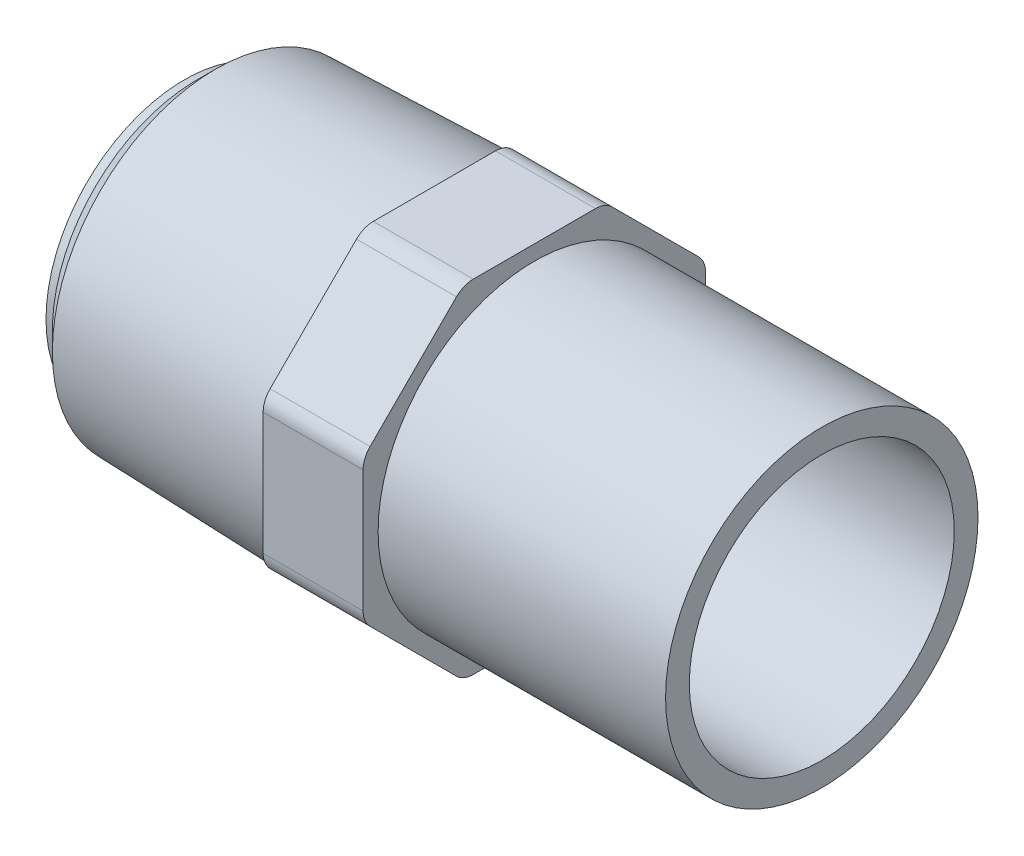
ISO-10303-21;
HEADER;
FILE_DESCRIPTION(('STEP AP214'),'2;1');
FILE_NAME('part.step','',(''),(''),'','','');
FILE_SCHEMA(('AUTOMOTIVE_DESIGN { 1 0 10303 214 1 1 1 1 }'));
ENDSEC;
DATA;
#1=APPLICATION_CONTEXT('core data for automotive mechanical design processes');
#2=APPLICATION_PROTOCOL_DEFINITION('international standard','automotive_design',2000,#1);
#3=PRODUCT_CONTEXT('',#1,'mechanical');
#4=PRODUCT('Part','Part','',(#3));
#5=PRODUCT_RELATED_PRODUCT_CATEGORY('part','',(#4));
#6=PRODUCT_DEFINITION_FORMATION('','',#4);
#7=PRODUCT_DEFINITION_CONTEXT('part definition',#1,'design');
#8=PRODUCT_DEFINITION('design','',#6,#7);
#9=PRODUCT_DEFINITION_SHAPE('','',#8);
#10=(LENGTH_UNIT() NAMED_UNIT(*) SI_UNIT(.MILLI.,.METRE.));
#11=(NAMED_UNIT(*) PLANE_ANGLE_UNIT() SI_UNIT($,.RADIAN.));
#12=(NAMED_UNIT(*) SI_UNIT($,.STERADIAN.) SOLID_ANGLE_UNIT());
#13=UNCERTAINTY_MEASURE_WITH_UNIT(LENGTH_MEASURE(1.E-05),#10,'distance_accuracy_value','');
#14=(GEOMETRIC_REPRESENTATION_CONTEXT(3) GLOBAL_UNCERTAINTY_ASSIGNED_CONTEXT((#13)) GLOBAL_UNIT_ASSIGNED_CONTEXT((#10,
#11,#12)) REPRESENTATION_CONTEXT('',''));
#15=CARTESIAN_POINT('',(0.,0.,0.));
#16=DIRECTION('',(0.,0.,1.));
#17=DIRECTION('',(1.,0.,0.));
#18=AXIS2_PLACEMENT_3D('',#15,#16,#17);
#19=CARTESIAN_POINT('',(-23.,-11.8,4.88772003600251));
#20=DIRECTION('',(1.,0.,0.));
#21=DIRECTION('',(0.,0.,-1.));
#22=AXIS2_PLACEMENT_3D('',#19,#20,#21);
#23=CYLINDRICAL_SURFACE('',#22,1.9);
#24=CARTESIAN_POINT('',(-31.,-11.8,4.88772003600251));
#25=DIRECTION('',(1.,0.,0.));
#26=DIRECTION('',(0.,0.,-1.));
#27=AXIS2_PLACEMENT_3D('',#24,#25,#26);
#28=CIRCLE('',#27,1.9);
#29=CARTESIAN_POINT('',(-31.,-13.7,4.8877200360025));
#30=VERTEX_POINT('',#29);
#31=CARTESIAN_POINT('',(-31.,-13.1435028842544,6.23122292025694));
#32=VERTEX_POINT('',#31);
#33=EDGE_CURVE('E323',#30,#32,#28,.F.);
#34=ORIENTED_EDGE('',*,*,#33,.F.);
#35=DIRECTION('',(1.,0.,0.));
#36=VECTOR('',#35,1.);
#37=CARTESIAN_POINT('',(-31.,-13.7,4.8877200360025));
#38=LINE('',#37,#36);
#39=CARTESIAN_POINT('',(-23.,-13.7,4.8877200360025));
#40=VERTEX_POINT('',#39);
#41=EDGE_CURVE('E218',#40,#30,#38,.F.);
#42=ORIENTED_EDGE('',*,*,#41,.F.);
#43=CARTESIAN_POINT('',(-23.,-11.8,4.88772003600251));
#44=DIRECTION('',(1.,0.,0.));
#45=DIRECTION('',(0.,0.,-1.));
#46=AXIS2_PLACEMENT_3D('',#43,#44,#45);
#47=CIRCLE('',#46,1.9);
#48=CARTESIAN_POINT('',(-23.,-13.1435028842544,6.23122292025695));
#49=VERTEX_POINT('',#48);
#50=EDGE_CURVE('E18',#40,#49,#47,.F.);
#51=ORIENTED_EDGE('',*,*,#50,.T.);
#52=DIRECTION('',(1.,0.,0.));
#53=VECTOR('',#52,1.);
#54=CARTESIAN_POINT('',(-31.,-13.1435028842544,6.23122292025694));
#55=LINE('',#54,#53);
#56=EDGE_CURVE('E203',#32,#49,#55,.T.);
#57=ORIENTED_EDGE('',*,*,#56,.F.);
#58=EDGE_LOOP('',(#34,#42,#51,#57));
#59=FACE_BOUND('',#58,.T.);
#60=ADVANCED_FACE('F15',(#59),#23,.T.);
#61=CARTESIAN_POINT('',(-23.,-11.8,-4.88772003600252));
#62=DIRECTION('',(1.,0.,0.));
#63=DIRECTION('',(0.,0.,-1.));
#64=AXIS2_PLACEMENT_3D('',#61,#62,#63);
#65=CYLINDRICAL_SURFACE('',#64,1.9);
#66=CARTESIAN_POINT('',(-31.,-11.8,-4.88772003600252));
#67=DIRECTION('',(1.,0.,0.));
#68=DIRECTION('',(0.,0.,-1.));
#69=AXIS2_PLACEMENT_3D('',#66,#67,#68);
#70=CIRCLE('',#69,1.9);
#71=CARTESIAN_POINT('',(-31.,-13.1435028842544,-6.23122292025696));
#72=VERTEX_POINT('',#71);
#73=CARTESIAN_POINT('',(-31.,-13.7,-4.88772003600252));
#74=VERTEX_POINT('',#73);
#75=EDGE_CURVE('E325',#72,#74,#70,.F.);
#76=ORIENTED_EDGE('',*,*,#75,.F.);
#77=DIRECTION('',(1.,0.,0.));
#78=VECTOR('',#77,1.);
#79=CARTESIAN_POINT('',(-31.,-13.1435028842544,-6.23122292025696));
#80=LINE('',#79,#78);
#81=CARTESIAN_POINT('',(-23.,-13.1435028842544,-6.23122292025696));
#82=VERTEX_POINT('',#81);
#83=EDGE_CURVE('E227',#82,#72,#80,.F.);
#84=ORIENTED_EDGE('',*,*,#83,.F.);
#85=CARTESIAN_POINT('',(-23.,-11.8,-4.88772003600252));
#86=DIRECTION('',(1.,0.,0.));
#87=DIRECTION('',(0.,0.,-1.));
#88=AXIS2_PLACEMENT_3D('',#85,#86,#87);
#89=CIRCLE('',#88,1.9);
#90=CARTESIAN_POINT('',(-23.,-13.7,-4.88772003600252));
#91=VERTEX_POINT('',#90);
#92=EDGE_CURVE('E336',#82,#91,#89,.F.);
#93=ORIENTED_EDGE('',*,*,#92,.T.);
#94=DIRECTION('',(1.,0.,0.));
#95=VECTOR('',#94,1.);
#96=CARTESIAN_POINT('',(-31.,-13.7,-4.88772003600252));
#97=LINE('',#96,#95);
#98=EDGE_CURVE('E222',#74,#91,#97,.T.);
#99=ORIENTED_EDGE('',*,*,#98,.F.);
#100=EDGE_LOOP('',(#76,#84,#93,#99));
#101=FACE_BOUND('',#100,.T.);
#102=ADVANCED_FACE('F340',(#101),#65,.T.);
#103=CARTESIAN_POINT('',(-23.,-4.88772003600251,-11.8));
#104=DIRECTION('',(1.,0.,0.));
#105=DIRECTION('',(0.,0.,-1.));
#106=AXIS2_PLACEMENT_3D('',#103,#104,#105);
#107=CYLINDRICAL_SURFACE('',#106,1.9);
#108=CARTESIAN_POINT('',(-31.,-4.88772003600251,-11.8));
#109=DIRECTION('',(1.,0.,0.));
#110=DIRECTION('',(0.,0.,-1.));
#111=AXIS2_PLACEMENT_3D('',#108,#109,#110);
#112=CIRCLE('',#111,1.9);
#113=CARTESIAN_POINT('',(-31.,-4.88772003600251,-13.7));
#114=VERTEX_POINT('',#113);
#115=CARTESIAN_POINT('',(-31.,-6.23122292025695,-13.1435028842544));
#116=VERTEX_POINT('',#115);
#117=EDGE_CURVE('E327',#114,#116,#112,.F.);
#118=ORIENTED_EDGE('',*,*,#117,.F.);
#119=DIRECTION('',(1.,0.,0.));
#120=VECTOR('',#119,1.);
#121=CARTESIAN_POINT('',(-31.,-4.88772003600251,-13.7));
#122=LINE('',#121,#120);
#123=CARTESIAN_POINT('',(-23.,-4.88772003600251,-13.7));
#124=VERTEX_POINT('',#123);
#125=EDGE_CURVE('E236',#124,#114,#122,.F.);
#126=ORIENTED_EDGE('',*,*,#125,.F.);
#127=CARTESIAN_POINT('',(-23.,-4.88772003600251,-11.8));
#128=DIRECTION('',(1.,0.,0.));
#129=DIRECTION('',(0.,0.,-1.));
#130=AXIS2_PLACEMENT_3D('',#127,#128,#129);
#131=CIRCLE('',#130,1.9);
#132=CARTESIAN_POINT('',(-23.,-6.23122292025695,-13.1435028842544));
#133=VERTEX_POINT('',#132);
#134=EDGE_CURVE('E335',#124,#133,#131,.F.);
#135=ORIENTED_EDGE('',*,*,#134,.T.);
#136=DIRECTION('',(1.,0.,0.));
#137=VECTOR('',#136,1.);
#138=CARTESIAN_POINT('',(-31.,-6.23122292025695,-13.1435028842544));
#139=LINE('',#138,#137);
#140=EDGE_CURVE('E231',#116,#133,#139,.T.);
#141=ORIENTED_EDGE('',*,*,#140,.F.);
#142=EDGE_LOOP('',(#118,#126,#135,#141));
#143=FACE_BOUND('',#142,.T.);
#144=ADVANCED_FACE('F355',(#143),#107,.T.);
#145=CARTESIAN_POINT('',(-23.,4.88772003600253,-11.8));
#146=DIRECTION('',(1.,0.,0.));
#147=DIRECTION('',(0.,0.,-1.));
#148=AXIS2_PLACEMENT_3D('',#145,#146,#147);
#149=CYLINDRICAL_SURFACE('',#148,1.89999999999999);
#150=CARTESIAN_POINT('',(-31.,4.88772003600253,-11.8));
#151=DIRECTION('',(1.,0.,0.));
#152=DIRECTION('',(0.,0.,-1.));
#153=AXIS2_PLACEMENT_3D('',#150,#151,#152);
#154=CIRCLE('',#153,1.89999999999999);
#155=CARTESIAN_POINT('',(-31.,6.23122292025696,-13.1435028842544));
#156=VERTEX_POINT('',#155);
#157=CARTESIAN_POINT('',(-31.,4.88772003600253,-13.7));
#158=VERTEX_POINT('',#157);
#159=EDGE_CURVE('E271',#156,#158,#154,.F.);
#160=ORIENTED_EDGE('',*,*,#159,.F.);
#161=DIRECTION('',(1.,0.,0.));
#162=VECTOR('',#161,1.);
#163=CARTESIAN_POINT('',(-31.,6.23122292025696,-13.1435028842544));
#164=LINE('',#163,#162);
#165=CARTESIAN_POINT('',(-23.,6.23122292025696,-13.1435028842544));
#166=VERTEX_POINT('',#165);
#167=EDGE_CURVE('E245',#166,#156,#164,.F.);
#168=ORIENTED_EDGE('',*,*,#167,.F.);
#169=CARTESIAN_POINT('',(-23.,4.88772003600253,-11.8));
#170=DIRECTION('',(1.,0.,0.));
#171=DIRECTION('',(0.,0.,-1.));
#172=AXIS2_PLACEMENT_3D('',#169,#170,#171);
#173=CIRCLE('',#172,1.89999999999999);
#174=CARTESIAN_POINT('',(-23.,4.88772003600253,-13.7));
#175=VERTEX_POINT('',#174);
#176=EDGE_CURVE('E333',#166,#175,#173,.F.);
#177=ORIENTED_EDGE('',*,*,#176,.T.);
#178=DIRECTION('',(1.,0.,0.));
#179=VECTOR('',#178,1.);
#180=CARTESIAN_POINT('',(-31.,4.88772003600253,-13.7));
#181=LINE('',#180,#179);
#182=EDGE_CURVE('E240',#158,#175,#181,.T.);
#183=ORIENTED_EDGE('',*,*,#182,.F.);
#184=EDGE_LOOP('',(#160,#168,#177,#183));
#185=FACE_BOUND('',#184,.T.);
#186=ADVANCED_FACE('F360',(#185),#149,.T.);
#187=CARTESIAN_POINT('',(-23.,11.8,-4.88772003600252));
#188=DIRECTION('',(1.,0.,0.));
#189=DIRECTION('',(0.,0.,-1.));
#190=AXIS2_PLACEMENT_3D('',#187,#188,#189);
#191=CYLINDRICAL_SURFACE('',#190,1.9);
#192=CARTESIAN_POINT('',(-31.,11.8,-4.88772003600252));
#193=DIRECTION('',(1.,0.,0.));
#194=DIRECTION('',(0.,0.,-1.));
#195=AXIS2_PLACEMENT_3D('',#192,#193,#194);
#196=CIRCLE('',#195,1.9);
#197=CARTESIAN_POINT('',(-31.,13.7,-4.88772003600252));
#198=VERTEX_POINT('',#197);
#199=CARTESIAN_POINT('',(-31.,13.1435028842544,-6.23122292025696));
#200=VERTEX_POINT('',#199);
#201=EDGE_CURVE('E269',#198,#200,#196,.F.);
#202=ORIENTED_EDGE('',*,*,#201,.F.);
#203=DIRECTION('',(1.,0.,0.));
#204=VECTOR('',#203,1.);
#205=CARTESIAN_POINT('',(-31.,13.7,-4.88772003600252));
#206=LINE('',#205,#204);
#207=CARTESIAN_POINT('',(-23.,13.7,-4.88772003600252));
#208=VERTEX_POINT('',#207);
#209=EDGE_CURVE('E254',#208,#198,#206,.F.);
#210=ORIENTED_EDGE('',*,*,#209,.F.);
#211=CARTESIAN_POINT('',(-23.,11.8,-4.88772003600252));
#212=DIRECTION('',(1.,0.,0.));
#213=DIRECTION('',(0.,0.,-1.));
#214=AXIS2_PLACEMENT_3D('',#211,#212,#213);
#215=CIRCLE('',#214,1.9);
#216=CARTESIAN_POINT('',(-23.,13.1435028842544,-6.23122292025696));
#217=VERTEX_POINT('',#216);
#218=EDGE_CURVE('E268',#208,#217,#215,.F.);
#219=ORIENTED_EDGE('',*,*,#218,.T.);
#220=DIRECTION('',(1.,0.,0.));
#221=VECTOR('',#220,1.);
#222=CARTESIAN_POINT('',(-31.,13.1435028842544,-6.23122292025696));
#223=LINE('',#222,#221);
#224=EDGE_CURVE('E249',#200,#217,#223,.T.);
#225=ORIENTED_EDGE('',*,*,#224,.F.);
#226=EDGE_LOOP('',(#202,#210,#219,#225));
#227=FACE_BOUND('',#226,.T.);
#228=ADVANCED_FACE('F266',(#227),#191,.T.);
#229=CARTESIAN_POINT('',(-23.,11.8,4.88772003600253));
#230=DIRECTION('',(1.,0.,0.));
#231=DIRECTION('',(0.,0.,-1.));
#232=AXIS2_PLACEMENT_3D('',#229,#230,#231);
#233=CYLINDRICAL_SURFACE('',#232,1.9);
#234=CARTESIAN_POINT('',(-31.,11.8,4.88772003600253));
#235=DIRECTION('',(1.,0.,0.));
#236=DIRECTION('',(0.,0.,-1.));
#237=AXIS2_PLACEMENT_3D('',#234,#235,#236);
#238=CIRCLE('',#237,1.9);
#239=CARTESIAN_POINT('',(-31.,13.1435028842544,6.23122292025697));
#240=VERTEX_POINT('',#239);
#241=CARTESIAN_POINT('',(-31.,13.7,4.88772003600253));
#242=VERTEX_POINT('',#241);
#243=EDGE_CURVE('E143',#240,#242,#238,.F.);
#244=ORIENTED_EDGE('',*,*,#243,.F.);
#245=DIRECTION('',(1.,0.,0.));
#246=VECTOR('',#245,1.);
#247=CARTESIAN_POINT('',(-31.,13.1435028842544,6.23122292025697));
#248=LINE('',#247,#246);
#249=CARTESIAN_POINT('',(-23.,13.1435028842544,6.23122292025697));
#250=VERTEX_POINT('',#249);
#251=EDGE_CURVE('E154',#250,#240,#248,.F.);
#252=ORIENTED_EDGE('',*,*,#251,.F.);
#253=CARTESIAN_POINT('',(-23.,11.8,4.88772003600253));
#254=DIRECTION('',(1.,0.,0.));
#255=DIRECTION('',(0.,0.,-1.));
#256=AXIS2_PLACEMENT_3D('',#253,#254,#255);
#257=CIRCLE('',#256,1.9);
#258=CARTESIAN_POINT('',(-23.,13.7,4.88772003600253));
#259=VERTEX_POINT('',#258);
#260=EDGE_CURVE('E277',#250,#259,#257,.F.);
#261=ORIENTED_EDGE('',*,*,#260,.T.);
#262=DIRECTION('',(1.,0.,0.));
#263=VECTOR('',#262,1.);
#264=CARTESIAN_POINT('',(-31.,13.7,4.88772003600253));
#265=LINE('',#264,#263);
#266=EDGE_CURVE('E156',#242,#259,#265,.T.);
#267=ORIENTED_EDGE('',*,*,#266,.F.);
#268=EDGE_LOOP('',(#244,#252,#261,#267));
#269=FACE_BOUND('',#268,.T.);
#270=ADVANCED_FACE('F276',(#269),#233,.T.);
#271=CARTESIAN_POINT('',(-23.,4.88772003600252,11.8));
#272=DIRECTION('',(1.,0.,0.));
#273=DIRECTION('',(0.,0.,-1.));
#274=AXIS2_PLACEMENT_3D('',#271,#272,#273);
#275=CYLINDRICAL_SURFACE('',#274,1.90000000000001);
#276=CARTESIAN_POINT('',(-31.,4.88772003600252,11.8));
#277=DIRECTION('',(1.,0.,0.));
#278=DIRECTION('',(0.,0.,-1.));
#279=AXIS2_PLACEMENT_3D('',#276,#277,#278);
#280=CIRCLE('',#279,1.90000000000001);
#281=CARTESIAN_POINT('',(-31.,4.88772003600253,13.7));
#282=VERTEX_POINT('',#281);
#283=CARTESIAN_POINT('',(-31.,6.23122292025696,13.1435028842544));
#284=VERTEX_POINT('',#283);
#285=EDGE_CURVE('E131',#282,#284,#280,.F.);
#286=ORIENTED_EDGE('',*,*,#285,.F.);
#287=DIRECTION('',(1.,0.,0.));
#288=VECTOR('',#287,1.);
#289=CARTESIAN_POINT('',(-31.,4.88772003600253,13.7));
#290=LINE('',#289,#288);
#291=CARTESIAN_POINT('',(-23.,4.88772003600253,13.7));
#292=VERTEX_POINT('',#291);
#293=EDGE_CURVE('E150',#292,#282,#290,.F.);
#294=ORIENTED_EDGE('',*,*,#293,.F.);
#295=CARTESIAN_POINT('',(-23.,4.88772003600252,11.8));
#296=DIRECTION('',(1.,0.,0.));
#297=DIRECTION('',(0.,0.,-1.));
#298=AXIS2_PLACEMENT_3D('',#295,#296,#297);
#299=CIRCLE('',#298,1.90000000000001);
#300=CARTESIAN_POINT('',(-23.,6.23122292025696,13.1435028842544));
#301=VERTEX_POINT('',#300);
#302=EDGE_CURVE('E33',#292,#301,#299,.F.);
#303=ORIENTED_EDGE('',*,*,#302,.T.);
#304=DIRECTION('',(1.,0.,0.));
#305=VECTOR('',#304,1.);
#306=CARTESIAN_POINT('',(-31.,6.23122292025696,13.1435028842544));
#307=LINE('',#306,#305);
#308=EDGE_CURVE('E146',#284,#301,#307,.T.);
#309=ORIENTED_EDGE('',*,*,#308,.F.);
#310=EDGE_LOOP('',(#286,#294,#303,#309));
#311=FACE_BOUND('',#310,.T.);
#312=ADVANCED_FACE('F147',(#311),#275,.T.);
#313=CARTESIAN_POINT('',(-31.,-13.7,13.7));
#314=DIRECTION('',(-1.,0.,0.));
#315=DIRECTION('',(0.,1.,0.));
#316=AXIS2_PLACEMENT_3D('',#313,#314,#315);
#317=PLANE('',#316);
#318=CARTESIAN_POINT('',(-31.,0.,0.));
#319=DIRECTION('',(1.,0.,0.));
#320=DIRECTION('',(0.,0.,-1.));
#321=AXIS2_PLACEMENT_3D('',#318,#319,#320);
#322=CIRCLE('',#321,13.606788060305);
#323=CARTESIAN_POINT('',(-31.,0.,-13.606788060305));
#324=VERTEX_POINT('',#323);
#325=EDGE_CURVE('E206',#324,#324,#322,.F.);
#326=ORIENTED_EDGE('',*,*,#325,.F.);
#327=EDGE_LOOP('',(#326));
#328=FACE_BOUND('',#327,.T.);
#329=ORIENTED_EDGE('',*,*,#33,.T.);
#330=DIRECTION('',(0.,-0.707106781186547,-0.707106781186548));
#331=VECTOR('',#330,1.);
#332=CARTESIAN_POINT('',(-31.,-9.68736290225571,9.68736290225569));
#333=LINE('',#332,#331);
#334=CARTESIAN_POINT('',(-31.,-6.23122292025696,13.1435028842544));
#335=VERTEX_POINT('',#334);
#336=EDGE_CURVE('E200',#335,#32,#333,.T.);
#337=ORIENTED_EDGE('',*,*,#336,.F.);
#338=CARTESIAN_POINT('',(-31.,-4.88772003600251,11.8));
#339=DIRECTION('',(1.,0.,0.));
#340=DIRECTION('',(0.,0.,-1.));
#341=AXIS2_PLACEMENT_3D('',#338,#339,#340);
#342=CIRCLE('',#341,1.90000000000002);
#343=CARTESIAN_POINT('',(-31.,-4.88772003600252,13.7));
#344=VERTEX_POINT('',#343);
#345=EDGE_CURVE('E319',#344,#335,#342,.T.);
#346=ORIENTED_EDGE('',*,*,#345,.F.);
#347=DIRECTION('',(0.,-1.,0.));
#348=VECTOR('',#347,1.);
#349=CARTESIAN_POINT('',(-31.,0.,13.7));
#350=LINE('',#349,#348);
#351=EDGE_CURVE('E141',#282,#344,#350,.T.);
#352=ORIENTED_EDGE('',*,*,#351,.F.);
#353=ORIENTED_EDGE('',*,*,#285,.T.);
#354=DIRECTION('',(0.,-0.707106781186548,0.707106781186547));
#355=VECTOR('',#354,1.);
#356=CARTESIAN_POINT('',(-31.,9.6873629022557,9.68736290225571));
#357=LINE('',#356,#355);
#358=EDGE_CURVE('E138',#240,#284,#357,.T.);
#359=ORIENTED_EDGE('',*,*,#358,.F.);
#360=ORIENTED_EDGE('',*,*,#243,.T.);
#361=DIRECTION('',(0.,0.,1.));
#362=VECTOR('',#361,1.);
#363=CARTESIAN_POINT('',(-31.,13.7,0.));
#364=LINE('',#363,#362);
#365=EDGE_CURVE('E255',#198,#242,#364,.T.);
#366=ORIENTED_EDGE('',*,*,#365,.F.);
#367=ORIENTED_EDGE('',*,*,#201,.T.);
#368=DIRECTION('',(0.,0.707106781186547,0.707106781186547));
#369=VECTOR('',#368,1.);
#370=CARTESIAN_POINT('',(-31.,9.6873629022557,-9.6873629022557));
#371=LINE('',#370,#369);
#372=EDGE_CURVE('E246',#156,#200,#371,.T.);
#373=ORIENTED_EDGE('',*,*,#372,.F.);
#374=ORIENTED_EDGE('',*,*,#159,.T.);
#375=DIRECTION('',(0.,1.,0.));
#376=VECTOR('',#375,1.);
#377=CARTESIAN_POINT('',(-31.,0.,-13.7));
#378=LINE('',#377,#376);
#379=EDGE_CURVE('E237',#114,#158,#378,.T.);
#380=ORIENTED_EDGE('',*,*,#379,.F.);
#381=ORIENTED_EDGE('',*,*,#117,.T.);
#382=DIRECTION('',(0.,0.707106781186548,-0.707106781186547));
#383=VECTOR('',#382,1.);
#384=CARTESIAN_POINT('',(-31.,-9.68736290225569,-9.6873629022557));
#385=LINE('',#384,#383);
#386=EDGE_CURVE('E228',#72,#116,#385,.T.);
#387=ORIENTED_EDGE('',*,*,#386,.F.);
#388=ORIENTED_EDGE('',*,*,#75,.T.);
#389=DIRECTION('',(0.,0.,-1.));
#390=VECTOR('',#389,1.);
#391=CARTESIAN_POINT('',(-31.,-13.7,0.));
#392=LINE('',#391,#390);
#393=EDGE_CURVE('E219',#30,#74,#392,.T.);
#394=ORIENTED_EDGE('',*,*,#393,.F.);
#395=EDGE_LOOP('',(#329,#337,#346,#352,#353,#359,#360,#366,#367,#373,#374,#380,#381,#387,#388,#394));
#396=FACE_BOUND('',#395,.T.);
#397=ADVANCED_FACE('F136',(#328,#396),#317,.T.);
#398=CARTESIAN_POINT('',(-23.,-4.88772003600251,11.8));
#399=DIRECTION('',(1.,0.,0.));
#400=DIRECTION('',(0.,0.,-1.));
#401=AXIS2_PLACEMENT_3D('',#398,#399,#400);
#402=CYLINDRICAL_SURFACE('',#401,1.90000000000002);
#403=ORIENTED_EDGE('',*,*,#345,.T.);
#404=DIRECTION('',(1.,0.,0.));
#405=VECTOR('',#404,1.);
#406=CARTESIAN_POINT('',(-31.,-6.23122292025696,13.1435028842544));
#407=LINE('',#406,#405);
#408=CARTESIAN_POINT('',(-23.,-6.23122292025696,13.1435028842544));
#409=VERTEX_POINT('',#408);
#410=EDGE_CURVE('E204',#409,#335,#407,.F.);
#411=ORIENTED_EDGE('',*,*,#410,.F.);
#412=CARTESIAN_POINT('',(-23.,-4.88772003600251,11.8));
#413=DIRECTION('',(1.,0.,0.));
#414=DIRECTION('',(0.,0.,-1.));
#415=AXIS2_PLACEMENT_3D('',#412,#413,#414);
#416=CIRCLE('',#415,1.90000000000002);
#417=CARTESIAN_POINT('',(-23.,-4.88772003600251,13.7));
#418=VERTEX_POINT('',#417);
#419=EDGE_CURVE('E83',#409,#418,#416,.F.);
#420=ORIENTED_EDGE('',*,*,#419,.T.);
#421=DIRECTION('',(1.,0.,0.));
#422=VECTOR('',#421,1.);
#423=CARTESIAN_POINT('',(-31.,-4.88772003600252,13.7));
#424=LINE('',#423,#422);
#425=EDGE_CURVE('E196',#344,#418,#424,.T.);
#426=ORIENTED_EDGE('',*,*,#425,.F.);
#427=EDGE_LOOP('',(#403,#411,#420,#426));
#428=FACE_BOUND('',#427,.T.);
#429=ADVANCED_FACE('F493',(#428),#402,.T.);
#430=CARTESIAN_POINT('',(-48.5033853320326,0.,0.));
#431=DIRECTION('',(1.,0.,0.));
#432=DIRECTION('',(0.,0.,-1.));
#433=AXIS2_PLACEMENT_3D('',#430,#431,#432);
#434=CONICAL_SURFACE('',#433,13.0616146679674,0.0311366738555786);
#435=CARTESIAN_POINT('',(-48.5033853320326,0.,0.));
#436=DIRECTION('',(-1.,0.,0.));
#437=DIRECTION('',(0.,1.,0.));
#438=AXIS2_PLACEMENT_3D('',#435,#436,#437);
#439=CIRCLE('',#438,13.0616146679674);
#440=CARTESIAN_POINT('',(-48.5033853320326,13.0616146679674,0.));
#441=VERTEX_POINT('',#440);
#442=EDGE_CURVE('E189',#441,#441,#439,.T.);
#443=ORIENTED_EDGE('',*,*,#442,.F.);
#444=EDGE_LOOP('',(#443));
#445=FACE_BOUND('',#444,.T.);
#446=ORIENTED_EDGE('',*,*,#325,.T.);
#447=EDGE_LOOP('',(#446));
#448=FACE_BOUND('',#447,.T.);
#449=ADVANCED_FACE('F485',(#445,#448),#434,.T.);
#450=CARTESIAN_POINT('',(-31.,-6.23122292025696,13.1435028842544));
#451=DIRECTION('',(0.,-0.707106781186548,0.707106781186547));
#452=DIRECTION('',(0.,-0.707106781186547,-0.707106781186548));
#453=AXIS2_PLACEMENT_3D('',#450,#451,#452);
#454=PLANE('',#453);
#455=ORIENTED_EDGE('',*,*,#336,.T.);
#456=ORIENTED_EDGE('',*,*,#56,.T.);
#457=CARTESIAN_POINT('',(-23.,-6.23122292025696,13.1435028842544));
#458=CARTESIAN_POINT('',(-23.,-6.51923458542352,12.8554912190879));
#459=CARTESIAN_POINT('',(-23.,-6.80724625059009,12.5674795539213));
#460=CARTESIAN_POINT('',(-23.,-7.38326958092321,11.9914562235882));
#461=CARTESIAN_POINT('',(-23.,-7.67128124608977,11.7034445584216));
#462=CARTESIAN_POINT('',(-23.,-8.24730457642289,11.1274212280885));
#463=CARTESIAN_POINT('',(-23.,-8.53531624158945,10.8394095629219));
#464=CARTESIAN_POINT('',(-23.,-9.11133957192258,10.2633862325888));
#465=CARTESIAN_POINT('',(-23.,-9.39935123708914,9.97537456742226));
#466=CARTESIAN_POINT('',(-23.,-9.97537456742226,9.39935123708914));
#467=CARTESIAN_POINT('',(-23.,-10.2633862325888,9.11133957192257));
#468=CARTESIAN_POINT('',(-23.,-10.8394095629219,8.53531624158945));
#469=CARTESIAN_POINT('',(-23.,-11.1274212280885,8.24730457642288));
#470=CARTESIAN_POINT('',(-23.,-11.7034445584216,7.67128124608976));
#471=CARTESIAN_POINT('',(-23.,-11.9914562235882,7.3832695809232));
#472=CARTESIAN_POINT('',(-23.,-12.5674795539213,6.80724625059008));
#473=CARTESIAN_POINT('',(-23.,-12.8554912190879,6.51923458542351));
#474=CARTESIAN_POINT('',(-23.,-13.1435028842544,6.23122292025695));
#475=B_SPLINE_CURVE_WITH_KNOTS('',3,(#457,#458,#459,#460,#461,#462,#463,#464,#465,#466,#467,
#468,#469,#470,#471,#472,#473,#474),.UNSPECIFIED.,.F.,.F.,(4,2,2,2,2,2,2,2,4),(0.,
1.22193000900063,2.44386001800126,3.66579002700189,4.88772003600252,6.10965004500316,
7.33158005400379,8.55351006300442,9.77544007200505),.UNSPECIFIED.);
#476=EDGE_CURVE('E195',#409,#49,#475,.T.);
#477=ORIENTED_EDGE('',*,*,#476,.F.);
#478=ORIENTED_EDGE('',*,*,#410,.T.);
#479=EDGE_LOOP('',(#455,#456,#477,#478));
#480=FACE_BOUND('',#479,.T.);
#481=ADVANCED_FACE('F478',(#480),#454,.T.);
#482=CARTESIAN_POINT('',(-31.,-13.7,4.8877200360025));
#483=DIRECTION('',(0.,-1.,0.));
#484=DIRECTION('',(0.,0.,-1.));
#485=AXIS2_PLACEMENT_3D('',#482,#483,#484);
#486=PLANE('',#485);
#487=ORIENTED_EDGE('',*,*,#393,.T.);
#488=ORIENTED_EDGE('',*,*,#98,.T.);
#489=DIRECTION('',(0.,0.,-1.));
#490=VECTOR('',#489,1.);
#491=CARTESIAN_POINT('',(-23.,-13.7,13.7));
#492=LINE('',#491,#490);
#493=EDGE_CURVE('E209',#40,#91,#492,.T.);
#494=ORIENTED_EDGE('',*,*,#493,.F.);
#495=ORIENTED_EDGE('',*,*,#41,.T.);
#496=EDGE_LOOP('',(#487,#488,#494,#495));
#497=FACE_BOUND('',#496,.T.);
#498=ADVANCED_FACE('F344',(#497),#486,.T.);
#499=CARTESIAN_POINT('',(-31.,-13.1435028842544,-6.23122292025696));
#500=DIRECTION('',(0.,-0.707106781186547,-0.707106781186548));
#501=DIRECTION('',(0.,0.707106781186548,-0.707106781186547));
#502=AXIS2_PLACEMENT_3D('',#499,#500,#501);
#503=PLANE('',#502);
#504=ORIENTED_EDGE('',*,*,#386,.T.);
#505=ORIENTED_EDGE('',*,*,#140,.T.);
#506=CARTESIAN_POINT('',(-23.,-13.1435028842544,-6.23122292025696));
#507=CARTESIAN_POINT('',(-23.,-12.8554912190879,-6.51923458542352));
#508=CARTESIAN_POINT('',(-23.,-12.5674795539213,-6.80724625059008));
#509=CARTESIAN_POINT('',(-23.,-11.9914562235882,-7.38326958092321));
#510=CARTESIAN_POINT('',(-23.,-11.7034445584216,-7.67128124608977));
#511=CARTESIAN_POINT('',(-23.,-11.1274212280885,-8.24730457642289));
#512=CARTESIAN_POINT('',(-23.,-10.8394095629219,-8.53531624158946));
#513=CARTESIAN_POINT('',(-23.,-10.2633862325888,-9.11133957192258));
#514=CARTESIAN_POINT('',(-23.,-9.97537456742226,-9.39935123708914));
#515=CARTESIAN_POINT('',(-23.,-9.39935123708913,-9.97537456742226));
#516=CARTESIAN_POINT('',(-23.,-9.11133957192257,-10.2633862325888));
#517=CARTESIAN_POINT('',(-23.,-8.53531624158945,-10.8394095629219));
#518=CARTESIAN_POINT('',(-23.,-8.24730457642289,-11.1274212280885));
#519=CARTESIAN_POINT('',(-23.,-7.67128124608976,-11.7034445584216));
#520=CARTESIAN_POINT('',(-23.,-7.3832695809232,-11.9914562235882));
#521=CARTESIAN_POINT('',(-23.,-6.80724625059008,-12.5674795539213));
#522=CARTESIAN_POINT('',(-23.,-6.51923458542351,-12.8554912190879));
#523=CARTESIAN_POINT('',(-23.,-6.23122292025695,-13.1435028842544));
#524=B_SPLINE_CURVE_WITH_KNOTS('',3,(#506,#507,#508,#509,#510,#511,#512,#513,#514,#515,#516,
#517,#518,#519,#520,#521,#522,#523),.UNSPECIFIED.,.F.,.F.,(4,2,2,2,2,2,2,2,4),(0.,
1.22193000900063,2.44386001800126,3.66579002700189,4.88772003600252,6.10965004500315,
7.33158005400379,8.55351006300442,9.77544007200505),.UNSPECIFIED.);
#525=EDGE_CURVE('E283',#82,#133,#524,.T.);
#526=ORIENTED_EDGE('',*,*,#525,.F.);
#527=ORIENTED_EDGE('',*,*,#83,.T.);
#528=EDGE_LOOP('',(#504,#505,#526,#527));
#529=FACE_BOUND('',#528,.T.);
#530=ADVANCED_FACE('F351',(#529),#503,.T.);
#531=CARTESIAN_POINT('',(-31.,-4.88772003600251,-13.7));
#532=DIRECTION('',(0.,0.,-1.));
#533=DIRECTION('',(0.,1.,0.));
#534=AXIS2_PLACEMENT_3D('',#531,#532,#533);
#535=PLANE('',#534);
#536=ORIENTED_EDGE('',*,*,#379,.T.);
#537=ORIENTED_EDGE('',*,*,#182,.T.);
#538=DIRECTION('',(0.,1.,0.));
#539=VECTOR('',#538,1.);
#540=CARTESIAN_POINT('',(-23.,0.,-13.7));
#541=LINE('',#540,#539);
#542=EDGE_CURVE('E280',#124,#175,#541,.T.);
#543=ORIENTED_EDGE('',*,*,#542,.F.);
#544=ORIENTED_EDGE('',*,*,#125,.T.);
#545=EDGE_LOOP('',(#536,#537,#543,#544));
#546=FACE_BOUND('',#545,.T.);
#547=ADVANCED_FACE('F357',(#546),#535,.T.);
#548=CARTESIAN_POINT('',(-31.,6.23122292025696,-13.1435028842544));
#549=DIRECTION('',(0.,0.707106781186547,-0.707106781186547));
#550=DIRECTION('',(0.,0.707106781186547,0.707106781186547));
#551=AXIS2_PLACEMENT_3D('',#548,#549,#550);
#552=PLANE('',#551);
#553=ORIENTED_EDGE('',*,*,#372,.T.);
#554=ORIENTED_EDGE('',*,*,#224,.T.);
#555=CARTESIAN_POINT('',(-23.,6.23122292025696,-13.1435028842544));
#556=CARTESIAN_POINT('',(-23.,6.51923458542352,-12.8554912190879));
#557=CARTESIAN_POINT('',(-23.,6.80724625059009,-12.5674795539213));
#558=CARTESIAN_POINT('',(-23.,7.38326958092321,-11.9914562235882));
#559=CARTESIAN_POINT('',(-23.,7.67128124608977,-11.7034445584216));
#560=CARTESIAN_POINT('',(-23.,8.2473045764229,-11.1274212280885));
#561=CARTESIAN_POINT('',(-23.,8.53531624158945,-10.8394095629219));
#562=CARTESIAN_POINT('',(-23.,9.11133957192258,-10.2633862325888));
#563=CARTESIAN_POINT('',(-23.,9.39935123708914,-9.97537456742226));
#564=CARTESIAN_POINT('',(-23.,9.97537456742226,-9.39935123708914));
#565=CARTESIAN_POINT('',(-23.,10.2633862325888,-9.11133957192258));
#566=CARTESIAN_POINT('',(-23.,10.8394095629219,-8.53531624158945));
#567=CARTESIAN_POINT('',(-23.,11.1274212280885,-8.24730457642289));
#568=CARTESIAN_POINT('',(-23.,11.7034445584216,-7.67128124608977));
#569=CARTESIAN_POINT('',(-23.,11.9914562235882,-7.38326958092321));
#570=CARTESIAN_POINT('',(-23.,12.5674795539213,-6.80724625059009));
#571=CARTESIAN_POINT('',(-23.,12.8554912190879,-6.51923458542353));
#572=CARTESIAN_POINT('',(-23.,13.1435028842544,-6.23122292025696));
#573=B_SPLINE_CURVE_WITH_KNOTS('',3,(#555,#556,#557,#558,#559,#560,#561,#562,#563,#564,#565,
#566,#567,#568,#569,#570,#571,#572),.UNSPECIFIED.,.F.,.F.,(4,2,2,2,2,2,2,2,4),(0.,
1.22193000900063,2.44386001800126,3.66579002700189,4.88772003600252,6.10965004500315,
7.33158005400379,8.55351006300441,9.77544007200505),.UNSPECIFIED.);
#574=EDGE_CURVE('E279',#166,#217,#573,.T.);
#575=ORIENTED_EDGE('',*,*,#574,.F.);
#576=ORIENTED_EDGE('',*,*,#167,.T.);
#577=EDGE_LOOP('',(#553,#554,#575,#576));
#578=FACE_BOUND('',#577,.T.);
#579=ADVANCED_FACE('F363',(#578),#552,.T.);
#580=CARTESIAN_POINT('',(-31.,13.7,-4.88772003600252));
#581=DIRECTION('',(0.,1.,0.));
#582=DIRECTION('',(0.,0.,1.));
#583=AXIS2_PLACEMENT_3D('',#580,#581,#582);
#584=PLANE('',#583);
#585=ORIENTED_EDGE('',*,*,#365,.T.);
#586=ORIENTED_EDGE('',*,*,#266,.T.);
#587=DIRECTION('',(0.,0.,-1.));
#588=VECTOR('',#587,1.);
#589=CARTESIAN_POINT('',(-23.,13.7,13.7));
#590=LINE('',#589,#588);
#591=EDGE_CURVE('E167',#208,#259,#590,.F.);
#592=ORIENTED_EDGE('',*,*,#591,.F.);
#593=ORIENTED_EDGE('',*,*,#209,.T.);
#594=EDGE_LOOP('',(#585,#586,#592,#593));
#595=FACE_BOUND('',#594,.T.);
#596=ADVANCED_FACE('F261',(#595),#584,.T.);
#597=CARTESIAN_POINT('',(-31.,13.1435028842544,6.23122292025697));
#598=DIRECTION('',(0.,0.707106781186547,0.707106781186548));
#599=DIRECTION('',(0.,-0.707106781186548,0.707106781186547));
#600=AXIS2_PLACEMENT_3D('',#597,#598,#599);
#601=PLANE('',#600);
#602=ORIENTED_EDGE('',*,*,#358,.T.);
#603=ORIENTED_EDGE('',*,*,#308,.T.);
#604=CARTESIAN_POINT('',(-23.,13.1435028842544,6.23122292025697));
#605=CARTESIAN_POINT('',(-23.,12.8554912190879,6.51923458542353));
#606=CARTESIAN_POINT('',(-23.,12.5674795539213,6.80724625059009));
#607=CARTESIAN_POINT('',(-23.,11.9914562235882,7.38326958092322));
#608=CARTESIAN_POINT('',(-23.,11.7034445584216,7.67128124608978));
#609=CARTESIAN_POINT('',(-23.,11.1274212280885,8.2473045764229));
#610=CARTESIAN_POINT('',(-23.,10.8394095629219,8.53531624158946));
#611=CARTESIAN_POINT('',(-23.,10.2633862325888,9.11133957192258));
#612=CARTESIAN_POINT('',(-23.,9.97537456742226,9.39935123708914));
#613=CARTESIAN_POINT('',(-23.,9.39935123708914,9.97537456742227));
#614=CARTESIAN_POINT('',(-23.,9.11133957192258,10.2633862325888));
#615=CARTESIAN_POINT('',(-23.,8.53531624158945,10.839409562922));
#616=CARTESIAN_POINT('',(-23.,8.24730457642289,11.1274212280885));
#617=CARTESIAN_POINT('',(-23.,7.67128124608977,11.7034445584216));
#618=CARTESIAN_POINT('',(-23.,7.38326958092321,11.9914562235882));
#619=CARTESIAN_POINT('',(-23.,6.80724625059008,12.5674795539213));
#620=CARTESIAN_POINT('',(-23.,6.51923458542352,12.8554912190879));
#621=CARTESIAN_POINT('',(-23.,6.23122292025696,13.1435028842544));
#622=B_SPLINE_CURVE_WITH_KNOTS('',3,(#604,#605,#606,#607,#608,#609,#610,#611,#612,#613,#614,
#615,#616,#617,#618,#619,#620,#621),.UNSPECIFIED.,.F.,.F.,(4,2,2,2,2,2,2,2,4),(0.,
1.22193000900063,2.44386001800126,3.66579002700189,4.88772003600252,6.10965004500315,
7.33158005400378,8.55351006300441,9.77544007200504),.UNSPECIFIED.);
#623=EDGE_CURVE('E162',#250,#301,#622,.T.);
#624=ORIENTED_EDGE('',*,*,#623,.F.);
#625=ORIENTED_EDGE('',*,*,#251,.T.);
#626=EDGE_LOOP('',(#602,#603,#624,#625));
#627=FACE_BOUND('',#626,.T.);
#628=ADVANCED_FACE('F152',(#627),#601,.T.);
#629=CARTESIAN_POINT('',(-31.,4.88772003600253,13.7));
#630=DIRECTION('',(0.,0.,1.));
#631=DIRECTION('',(0.,-1.,0.));
#632=AXIS2_PLACEMENT_3D('',#629,#630,#631);
#633=PLANE('',#632);
#634=ORIENTED_EDGE('',*,*,#351,.T.);
#635=ORIENTED_EDGE('',*,*,#425,.T.);
#636=DIRECTION('',(0.,-1.,0.));
#637=VECTOR('',#636,1.);
#638=CARTESIAN_POINT('',(-23.,0.,13.7));
#639=LINE('',#638,#637);
#640=EDGE_CURVE('E166',#292,#418,#639,.T.);
#641=ORIENTED_EDGE('',*,*,#640,.F.);
#642=ORIENTED_EDGE('',*,*,#293,.T.);
#643=EDGE_LOOP('',(#634,#635,#641,#642));
#644=FACE_BOUND('',#643,.T.);
#645=ADVANCED_FACE('F409',(#644),#633,.T.);
#646=CARTESIAN_POINT('',(-50.,0.,0.));
#647=DIRECTION('',(1.,0.,0.));
#648=DIRECTION('',(0.,0.,-1.));
#649=AXIS2_PLACEMENT_3D('',#646,#647,#648);
#650=CONICAL_SURFACE('',#649,11.565,0.78539816339745);
#651=CARTESIAN_POINT('',(-50.,0.,0.));
#652=DIRECTION('',(1.,0.,0.));
#653=DIRECTION('',(0.,0.,-1.));
#654=AXIS2_PLACEMENT_3D('',#651,#652,#653);
#655=CIRCLE('',#654,11.565);
#656=CARTESIAN_POINT('',(-50.,0.,-11.565));
#657=VERTEX_POINT('',#656);
#658=EDGE_CURVE('E216',#657,#657,#655,.F.);
#659=ORIENTED_EDGE('',*,*,#658,.F.);
#660=EDGE_LOOP('',(#659));
#661=FACE_BOUND('',#660,.T.);
#662=ORIENTED_EDGE('',*,*,#442,.T.);
#663=EDGE_LOOP('',(#662));
#664=FACE_BOUND('',#663,.T.);
#665=ADVANCED_FACE('F405',(#661,#664),#650,.T.);
#666=CARTESIAN_POINT('',(-23.,13.7,13.7));
#667=DIRECTION('',(1.,0.,0.));
#668=DIRECTION('',(0.,-1.,0.));
#669=AXIS2_PLACEMENT_3D('',#666,#667,#668);
#670=PLANE('',#669);
#671=CARTESIAN_POINT('',(-23.,0.,0.));
#672=DIRECTION('',(-1.,0.,0.));
#673=DIRECTION('',(0.,0.,1.));
#674=AXIS2_PLACEMENT_3D('',#671,#672,#673);
#675=CIRCLE('',#674,12.5);
#676=CARTESIAN_POINT('',(-23.,0.,12.5));
#677=VERTEX_POINT('',#676);
#678=EDGE_CURVE('E312',#677,#677,#675,.F.);
#679=ORIENTED_EDGE('',*,*,#678,.F.);
#680=EDGE_LOOP('',(#679));
#681=FACE_BOUND('',#680,.T.);
#682=ORIENTED_EDGE('',*,*,#302,.F.);
#683=ORIENTED_EDGE('',*,*,#640,.T.);
#684=ORIENTED_EDGE('',*,*,#419,.F.);
#685=ORIENTED_EDGE('',*,*,#476,.T.);
#686=ORIENTED_EDGE('',*,*,#50,.F.);
#687=ORIENTED_EDGE('',*,*,#493,.T.);
#688=ORIENTED_EDGE('',*,*,#92,.F.);
#689=ORIENTED_EDGE('',*,*,#525,.T.);
#690=ORIENTED_EDGE('',*,*,#134,.F.);
#691=ORIENTED_EDGE('',*,*,#542,.T.);
#692=ORIENTED_EDGE('',*,*,#176,.F.);
#693=ORIENTED_EDGE('',*,*,#574,.T.);
#694=ORIENTED_EDGE('',*,*,#218,.F.);
#695=ORIENTED_EDGE('',*,*,#591,.T.);
#696=ORIENTED_EDGE('',*,*,#260,.F.);
#697=ORIENTED_EDGE('',*,*,#623,.T.);
#698=EDGE_LOOP('',(#682,#683,#684,#685,#686,#687,#688,#689,#690,#691,#692,#693,#694,#695,#696,#697));
#699=FACE_BOUND('',#698,.T.);
#700=ADVANCED_FACE('F180',(#681,#699),#670,.T.);
#701=CARTESIAN_POINT('',(-50.,-11.565,11.7037821083172));
#702=DIRECTION('',(-1.,0.,0.));
#703=DIRECTION('',(0.,1.,0.));
#704=AXIS2_PLACEMENT_3D('',#701,#702,#703);
#705=PLANE('',#704);
#706=CARTESIAN_POINT('',(-50.,0.,0.));
#707=DIRECTION('',(-1.,0.,0.));
#708=DIRECTION('',(0.,0.,1.));
#709=AXIS2_PLACEMENT_3D('',#706,#707,#708);
#710=CIRCLE('',#709,11.075);
#711=CARTESIAN_POINT('',(-50.,0.,11.075));
#712=VERTEX_POINT('',#711);
#713=EDGE_CURVE('E309',#712,#712,#710,.T.);
#714=ORIENTED_EDGE('',*,*,#713,.F.);
#715=EDGE_LOOP('',(#714));
#716=FACE_BOUND('',#715,.T.);
#717=ORIENTED_EDGE('',*,*,#658,.T.);
#718=EDGE_LOOP('',(#717));
#719=FACE_BOUND('',#718,.T.);
#720=ADVANCED_FACE('F178',(#716,#719),#705,.T.);
#721=CARTESIAN_POINT('',(-23.,0.,0.));
#722=DIRECTION('',(-1.,0.,0.));
#723=DIRECTION('',(0.,0.,1.));
#724=AXIS2_PLACEMENT_3D('',#721,#722,#723);
#725=CYLINDRICAL_SURFACE('',#724,12.5);
#726=ORIENTED_EDGE('',*,*,#678,.T.);
#727=EDGE_LOOP('',(#726));
#728=FACE_BOUND('',#727,.T.);
#729=CARTESIAN_POINT('',(0.,0.,0.));
#730=DIRECTION('',(-1.,0.,0.));
#731=DIRECTION('',(0.,0.,1.));
#732=AXIS2_PLACEMENT_3D('',#729,#730,#731);
#733=CIRCLE('',#732,12.5);
#734=CARTESIAN_POINT('',(0.,0.,12.5));
#735=VERTEX_POINT('',#734);
#736=EDGE_CURVE('E306',#735,#735,#733,.F.);
#737=ORIENTED_EDGE('',*,*,#736,.F.);
#738=EDGE_LOOP('',(#737));
#739=FACE_BOUND('',#738,.T.);
#740=ADVANCED_FACE('F391',(#728,#739),#725,.T.);
#741=CARTESIAN_POINT('',(-51.,0.,0.));
#742=DIRECTION('',(-1.,0.,0.));
#743=DIRECTION('',(0.,0.,1.));
#744=AXIS2_PLACEMENT_3D('',#741,#742,#743);
#745=CYLINDRICAL_SURFACE('',#744,11.075);
#746=CARTESIAN_POINT('',(-51.,0.,0.));
#747=DIRECTION('',(-1.,0.,0.));
#748=DIRECTION('',(0.,0.,1.));
#749=AXIS2_PLACEMENT_3D('',#746,#747,#748);
#750=CIRCLE('',#749,11.075);
#751=CARTESIAN_POINT('',(-51.,0.,11.075));
#752=VERTEX_POINT('',#751);
#753=EDGE_CURVE('E303',#752,#752,#750,.T.);
#754=ORIENTED_EDGE('',*,*,#753,.F.);
#755=EDGE_LOOP('',(#754));
#756=FACE_BOUND('',#755,.T.);
#757=ORIENTED_EDGE('',*,*,#713,.T.);
#758=EDGE_LOOP('',(#757));
#759=FACE_BOUND('',#758,.T.);
#760=ADVANCED_FACE('F388',(#756,#759),#745,.T.);
#761=CARTESIAN_POINT('',(0.,12.5,12.6500021083112));
#762=DIRECTION('',(1.,0.,0.));
#763=DIRECTION('',(0.,-1.,0.));
#764=AXIS2_PLACEMENT_3D('',#761,#762,#763);
#765=PLANE('',#764);
#766=CARTESIAN_POINT('',(0.,0.,0.));
#767=DIRECTION('',(-1.,0.,0.));
#768=DIRECTION('',(0.,0.,1.));
#769=AXIS2_PLACEMENT_3D('',#766,#767,#768);
#770=CIRCLE('',#769,10.6);
#771=CARTESIAN_POINT('',(0.,0.,10.6));
#772=VERTEX_POINT('',#771);
#773=EDGE_CURVE('E24',#772,#772,#770,.F.);
#774=ORIENTED_EDGE('',*,*,#773,.F.);
#775=EDGE_LOOP('',(#774));
#776=FACE_BOUND('',#775,.T.);
#777=ORIENTED_EDGE('',*,*,#736,.T.);
#778=EDGE_LOOP('',(#777));
#779=FACE_BOUND('',#778,.T.);
#780=ADVANCED_FACE('F381',(#776,#779),#765,.T.);
#781=CARTESIAN_POINT('',(-51.,-11.075,11.2079021082998));
#782=DIRECTION('',(-1.,0.,0.));
#783=DIRECTION('',(0.,1.,0.));
#784=AXIS2_PLACEMENT_3D('',#781,#782,#783);
#785=PLANE('',#784);
#786=CARTESIAN_POINT('',(-51.,0.,0.));
#787=DIRECTION('',(-1.,0.,0.));
#788=DIRECTION('',(0.,0.,1.));
#789=AXIS2_PLACEMENT_3D('',#786,#787,#788);
#790=CIRCLE('',#789,10.6);
#791=CARTESIAN_POINT('',(-51.,0.,10.6));
#792=VERTEX_POINT('',#791);
#793=EDGE_CURVE('E9',#792,#792,#790,.T.);
#794=ORIENTED_EDGE('',*,*,#793,.F.);
#795=EDGE_LOOP('',(#794));
#796=FACE_BOUND('',#795,.T.);
#797=ORIENTED_EDGE('',*,*,#753,.T.);
#798=EDGE_LOOP('',(#797));
#799=FACE_BOUND('',#798,.T.);
#800=ADVANCED_FACE('F375',(#796,#799),#785,.T.);
#801=CARTESIAN_POINT('',(0.,0.,0.));
#802=DIRECTION('',(-1.,0.,0.));
#803=DIRECTION('',(0.,0.,1.));
#804=AXIS2_PLACEMENT_3D('',#801,#802,#803);
#805=CYLINDRICAL_SURFACE('',#804,10.6);
#806=ORIENTED_EDGE('',*,*,#773,.T.);
#807=EDGE_LOOP('',(#806));
#808=FACE_BOUND('',#807,.T.);
#809=ORIENTED_EDGE('',*,*,#793,.T.);
#810=EDGE_LOOP('',(#809));
#811=FACE_BOUND('',#810,.T.);
#812=ADVANCED_FACE('F373',(#808,#811),#805,.F.);
#813=CLOSED_SHELL('',(#60,#102,#144,#186,#228,#270,#312,#397,#429,#449,#481,#498,#530,#547,#579,
#596,#628,#645,#665,#700,#720,#740,#760,#780,#800,#812));
#814=MANIFOLD_SOLID_BREP('B1',#813);
#815=ADVANCED_BREP_SHAPE_REPRESENTATION('',(#18,#814),#14);
#816=SHAPE_DEFINITION_REPRESENTATION(#9,#815);
ENDSEC;
END-ISO-10303-21;
